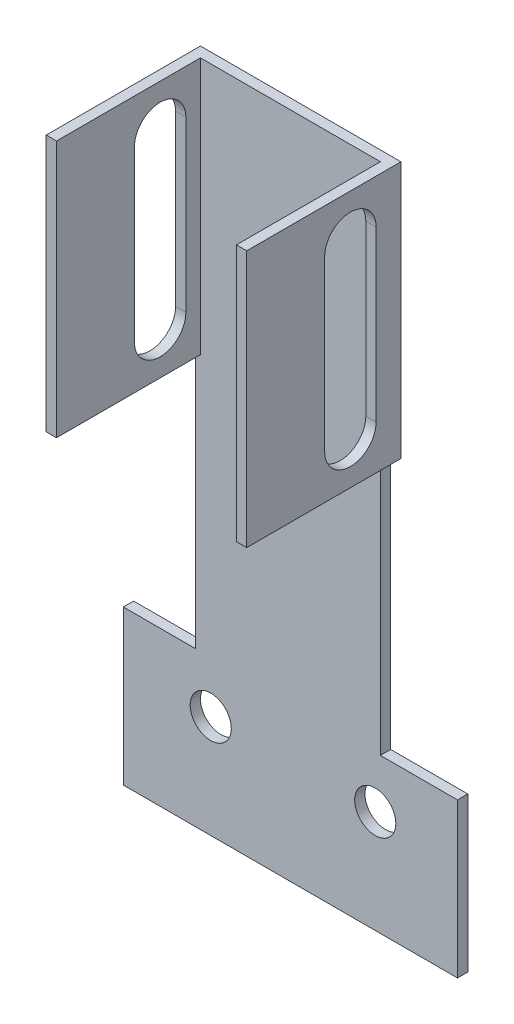
ISO-10303-21;
HEADER;
FILE_DESCRIPTION(('STEP AP214'),'2;1');
FILE_NAME('part.step','',(''),(''),'','','');
FILE_SCHEMA(('AUTOMOTIVE_DESIGN { 1 0 10303 214 1 1 1 1 }'));
ENDSEC;
DATA;
#1=APPLICATION_CONTEXT('core data for automotive mechanical design processes');
#2=APPLICATION_PROTOCOL_DEFINITION('international standard','automotive_design',2000,#1);
#3=PRODUCT_CONTEXT('',#1,'mechanical');
#4=PRODUCT('Part','Part','',(#3));
#5=PRODUCT_RELATED_PRODUCT_CATEGORY('part','',(#4));
#6=PRODUCT_DEFINITION_FORMATION('','',#4);
#7=PRODUCT_DEFINITION_CONTEXT('part definition',#1,'design');
#8=PRODUCT_DEFINITION('design','',#6,#7);
#9=PRODUCT_DEFINITION_SHAPE('','',#8);
#10=(LENGTH_UNIT() NAMED_UNIT(*) SI_UNIT(.MILLI.,.METRE.));
#11=(NAMED_UNIT(*) PLANE_ANGLE_UNIT() SI_UNIT($,.RADIAN.));
#12=(NAMED_UNIT(*) SI_UNIT($,.STERADIAN.) SOLID_ANGLE_UNIT());
#13=UNCERTAINTY_MEASURE_WITH_UNIT(LENGTH_MEASURE(1.E-05),#10,'distance_accuracy_value','');
#14=(GEOMETRIC_REPRESENTATION_CONTEXT(3) GLOBAL_UNCERTAINTY_ASSIGNED_CONTEXT((#13)) GLOBAL_UNIT_ASSIGNED_CONTEXT((#10,
#11,#12)) REPRESENTATION_CONTEXT('',''));
#15=CARTESIAN_POINT('',(0.,0.,0.));
#16=DIRECTION('',(0.,0.,1.));
#17=DIRECTION('',(1.,0.,0.));
#18=AXIS2_PLACEMENT_3D('',#15,#16,#17);
#19=CARTESIAN_POINT('',(22.4691789051287,13.9299732070661,2.));
#20=DIRECTION('',(-1.,0.,0.));
#21=DIRECTION('',(0.,0.,1.));
#22=AXIS2_PLACEMENT_3D('',#19,#20,#21);
#23=PLANE('',#22);
#24=DIRECTION('',(0.,0.,-1.));
#25=VECTOR('',#24,1.);
#26=CARTESIAN_POINT('',(22.4691789051287,63.9299732070661,0.));
#27=LINE('',#26,#25);
#28=CARTESIAN_POINT('',(22.4691789051287,63.9299732070661,2.));
#29=VERTEX_POINT('',#28);
#30=CARTESIAN_POINT('',(22.4691789051287,63.9299732070661,0.));
#31=VERTEX_POINT('',#30);
#32=EDGE_CURVE('E290',#29,#31,#27,.T.);
#33=ORIENTED_EDGE('',*,*,#32,.F.);
#34=DIRECTION('',(0.,1.,0.));
#35=VECTOR('',#34,1.);
#36=CARTESIAN_POINT('',(22.4691789051287,13.9299732070661,2.));
#37=LINE('',#36,#35);
#38=CARTESIAN_POINT('',(22.4691789051287,13.9299732070661,2.));
#39=VERTEX_POINT('',#38);
#40=EDGE_CURVE('E327',#39,#29,#37,.T.);
#41=ORIENTED_EDGE('',*,*,#40,.F.);
#42=DIRECTION('',(0.,0.,-1.));
#43=VECTOR('',#42,1.);
#44=CARTESIAN_POINT('',(22.4691789051287,13.9299732070661,2.));
#45=LINE('',#44,#43);
#46=CARTESIAN_POINT('',(22.4691789051287,13.9299732070661,0.));
#47=VERTEX_POINT('',#46);
#48=EDGE_CURVE('E359',#39,#47,#45,.T.);
#49=ORIENTED_EDGE('',*,*,#48,.T.);
#50=DIRECTION('',(0.,1.,0.));
#51=VECTOR('',#50,1.);
#52=CARTESIAN_POINT('',(22.4691789051287,13.9299732070661,0.));
#53=LINE('',#52,#51);
#54=EDGE_CURVE('E346',#47,#31,#53,.T.);
#55=ORIENTED_EDGE('',*,*,#54,.T.);
#56=EDGE_LOOP('',(#33,#41,#49,#55));
#57=FACE_BOUND('',#56,.T.);
#58=ADVANCED_FACE('F35',(#57),#23,.F.);
#59=CARTESIAN_POINT('',(0.,0.,2.));
#60=DIRECTION('',(0.,0.,-1.));
#61=DIRECTION('',(-1.,0.,0.));
#62=AXIS2_PLACEMENT_3D('',#59,#60,#61);
#63=PLANE('',#62);
#64=DIRECTION('',(0.,-1.,0.));
#65=VECTOR('',#64,1.);
#66=CARTESIAN_POINT('',(-12.5308210948713,0.,2.));
#67=LINE('',#66,#65);
#68=CARTESIAN_POINT('',(-12.5308210948713,113.929973207066,2.));
#69=VERTEX_POINT('',#68);
#70=CARTESIAN_POINT('',(-12.5308210948713,63.9299732070661,2.));
#71=VERTEX_POINT('',#70);
#72=EDGE_CURVE('E271',#69,#71,#67,.T.);
#73=ORIENTED_EDGE('',*,*,#72,.T.);
#74=DIRECTION('',(-1.,0.,0.));
#75=VECTOR('',#74,1.);
#76=CARTESIAN_POINT('',(0.,63.9299732070661,2.));
#77=LINE('',#76,#75);
#78=CARTESIAN_POINT('',(-13.5308210948713,63.9299732070661,2.));
#79=VERTEX_POINT('',#78);
#80=EDGE_CURVE('E268',#71,#79,#77,.T.);
#81=ORIENTED_EDGE('',*,*,#80,.T.);
#82=DIRECTION('',(0.,-1.,0.));
#83=VECTOR('',#82,1.);
#84=CARTESIAN_POINT('',(-13.5308210948713,13.9299732070661,2.));
#85=LINE('',#84,#83);
#86=CARTESIAN_POINT('',(-13.5308210948713,13.9299732070661,2.));
#87=VERTEX_POINT('',#86);
#88=EDGE_CURVE('E333',#79,#87,#85,.T.);
#89=ORIENTED_EDGE('',*,*,#88,.T.);
#90=DIRECTION('',(-1.,0.,0.));
#91=VECTOR('',#90,1.);
#92=CARTESIAN_POINT('',(-27.5308210948713,13.9299732070661,2.));
#93=LINE('',#92,#91);
#94=CARTESIAN_POINT('',(-27.5308210948713,13.9299732070661,2.));
#95=VERTEX_POINT('',#94);
#96=EDGE_CURVE('E335',#87,#95,#93,.T.);
#97=ORIENTED_EDGE('',*,*,#96,.T.);
#98=DIRECTION('',(0.,-1.,0.));
#99=VECTOR('',#98,1.);
#100=CARTESIAN_POINT('',(-27.5308210948713,-16.0700267929339,2.));
#101=LINE('',#100,#99);
#102=CARTESIAN_POINT('',(-27.5308210948713,-16.0700267929339,2.));
#103=VERTEX_POINT('',#102);
#104=EDGE_CURVE('E317',#95,#103,#101,.T.);
#105=ORIENTED_EDGE('',*,*,#104,.T.);
#106=DIRECTION('',(1.,0.,0.));
#107=VECTOR('',#106,1.);
#108=CARTESIAN_POINT('',(-27.5308210948713,-16.0700267929339,2.));
#109=LINE('',#108,#107);
#110=CARTESIAN_POINT('',(37.4691789051287,-16.0700267929339,2.));
#111=VERTEX_POINT('',#110);
#112=EDGE_CURVE('E320',#103,#111,#109,.T.);
#113=ORIENTED_EDGE('',*,*,#112,.T.);
#114=DIRECTION('',(0.,1.,0.));
#115=VECTOR('',#114,1.);
#116=CARTESIAN_POINT('',(37.4691789051287,-16.0700267929339,2.));
#117=LINE('',#116,#115);
#118=CARTESIAN_POINT('',(37.4691789051287,13.9299732070661,2.));
#119=VERTEX_POINT('',#118);
#120=EDGE_CURVE('E323',#111,#119,#117,.T.);
#121=ORIENTED_EDGE('',*,*,#120,.T.);
#122=DIRECTION('',(-1.,0.,0.));
#123=VECTOR('',#122,1.);
#124=CARTESIAN_POINT('',(37.4691789051287,13.9299732070661,2.));
#125=LINE('',#124,#123);
#126=EDGE_CURVE('E325',#119,#39,#125,.T.);
#127=ORIENTED_EDGE('',*,*,#126,.T.);
#128=ORIENTED_EDGE('',*,*,#40,.T.);
#129=DIRECTION('',(0.,1.,0.));
#130=VECTOR('',#129,1.);
#131=CARTESIAN_POINT('',(22.4691789051287,0.,2.));
#132=LINE('',#131,#130);
#133=CARTESIAN_POINT('',(22.4691789051287,113.929973207066,2.));
#134=VERTEX_POINT('',#133);
#135=EDGE_CURVE('E301',#29,#134,#132,.T.);
#136=ORIENTED_EDGE('',*,*,#135,.T.);
#137=DIRECTION('',(-1.,0.,0.));
#138=VECTOR('',#137,1.);
#139=CARTESIAN_POINT('',(-13.5308210948713,113.929973207066,2.));
#140=LINE('',#139,#138);
#141=EDGE_CURVE('E330',#134,#69,#140,.T.);
#142=ORIENTED_EDGE('',*,*,#141,.T.);
#143=EDGE_LOOP('',(#73,#81,#89,#97,#105,#113,#121,#127,#128,#136,#142));
#144=FACE_BOUND('',#143,.T.);
#145=CARTESIAN_POINT('',(21.4691789051287,3.92997320706607,2.));
#146=DIRECTION('',(0.,0.,1.));
#147=DIRECTION('',(1.,0.,0.));
#148=AXIS2_PLACEMENT_3D('',#145,#146,#147);
#149=CIRCLE('',#148,4.);
#150=CARTESIAN_POINT('',(25.4691789051287,3.92997320706607,2.));
#151=VERTEX_POINT('',#150);
#152=EDGE_CURVE('E311',#151,#151,#149,.T.);
#153=ORIENTED_EDGE('',*,*,#152,.F.);
#154=EDGE_LOOP('',(#153));
#155=FACE_BOUND('',#154,.T.);
#156=CARTESIAN_POINT('',(-10.5308210948713,3.92997320706607,2.));
#157=DIRECTION('',(0.,0.,1.));
#158=DIRECTION('',(1.,0.,0.));
#159=AXIS2_PLACEMENT_3D('',#156,#157,#158);
#160=CIRCLE('',#159,4.);
#161=CARTESIAN_POINT('',(-6.53082109487132,3.92997320706607,2.));
#162=VERTEX_POINT('',#161);
#163=EDGE_CURVE('E305',#162,#162,#160,.T.);
#164=ORIENTED_EDGE('',*,*,#163,.F.);
#165=EDGE_LOOP('',(#164));
#166=FACE_BOUND('',#165,.T.);
#167=ADVANCED_FACE('F417',(#144,#155,#166),#63,.F.);
#168=CARTESIAN_POINT('',(0.,0.,0.));
#169=DIRECTION('',(0.,0.,-1.));
#170=DIRECTION('',(-1.,0.,0.));
#171=AXIS2_PLACEMENT_3D('',#168,#169,#170);
#172=PLANE('',#171);
#173=DIRECTION('',(0.,-1.,0.));
#174=VECTOR('',#173,1.);
#175=CARTESIAN_POINT('',(-13.5308210948713,13.9299732070661,0.));
#176=LINE('',#175,#174);
#177=CARTESIAN_POINT('',(-13.5308210948713,63.9299732070661,0.));
#178=VERTEX_POINT('',#177);
#179=CARTESIAN_POINT('',(-13.5308210948713,13.9299732070661,0.));
#180=VERTEX_POINT('',#179);
#181=EDGE_CURVE('E351',#178,#180,#176,.T.);
#182=ORIENTED_EDGE('',*,*,#181,.F.);
#183=DIRECTION('',(1.,0.,0.));
#184=VECTOR('',#183,1.);
#185=CARTESIAN_POINT('',(-14.5308210948713,63.9299732070661,0.));
#186=LINE('',#185,#184);
#187=CARTESIAN_POINT('',(-14.5308210948713,63.9299732070661,0.));
#188=VERTEX_POINT('',#187);
#189=EDGE_CURVE('E266',#188,#178,#186,.T.);
#190=ORIENTED_EDGE('',*,*,#189,.F.);
#191=DIRECTION('',(0.,1.,0.));
#192=VECTOR('',#191,1.);
#193=CARTESIAN_POINT('',(-14.5308210948713,113.929973207066,0.));
#194=LINE('',#193,#192);
#195=CARTESIAN_POINT('',(-14.5308210948713,113.929973207066,0.));
#196=VERTEX_POINT('',#195);
#197=EDGE_CURVE('E245',#188,#196,#194,.T.);
#198=ORIENTED_EDGE('',*,*,#197,.T.);
#199=DIRECTION('',(-1.,0.,0.));
#200=VECTOR('',#199,1.);
#201=CARTESIAN_POINT('',(-13.5308210948713,113.929973207066,0.));
#202=LINE('',#201,#200);
#203=CARTESIAN_POINT('',(24.4691789051287,113.929973207066,0.));
#204=VERTEX_POINT('',#203);
#205=EDGE_CURVE('E349',#204,#196,#202,.T.);
#206=ORIENTED_EDGE('',*,*,#205,.F.);
#207=DIRECTION('',(0.,1.,0.));
#208=VECTOR('',#207,1.);
#209=CARTESIAN_POINT('',(24.4691789051287,113.929973207066,0.));
#210=LINE('',#209,#208);
#211=CARTESIAN_POINT('',(24.4691789051287,63.9299732070661,0.));
#212=VERTEX_POINT('',#211);
#213=EDGE_CURVE('E283',#212,#204,#210,.T.);
#214=ORIENTED_EDGE('',*,*,#213,.F.);
#215=DIRECTION('',(-1.,0.,0.));
#216=VECTOR('',#215,1.);
#217=CARTESIAN_POINT('',(24.4691789051287,63.9299732070661,0.));
#218=LINE('',#217,#216);
#219=EDGE_CURVE('E286',#212,#31,#218,.T.);
#220=ORIENTED_EDGE('',*,*,#219,.T.);
#221=ORIENTED_EDGE('',*,*,#54,.F.);
#222=DIRECTION('',(-1.,0.,0.));
#223=VECTOR('',#222,1.);
#224=CARTESIAN_POINT('',(37.4691789051287,13.9299732070661,0.));
#225=LINE('',#224,#223);
#226=CARTESIAN_POINT('',(37.4691789051287,13.9299732070661,0.));
#227=VERTEX_POINT('',#226);
#228=EDGE_CURVE('E344',#227,#47,#225,.T.);
#229=ORIENTED_EDGE('',*,*,#228,.F.);
#230=DIRECTION('',(0.,1.,0.));
#231=VECTOR('',#230,1.);
#232=CARTESIAN_POINT('',(37.4691789051287,-16.0700267929339,0.));
#233=LINE('',#232,#231);
#234=CARTESIAN_POINT('',(37.4691789051287,-16.0700267929339,0.));
#235=VERTEX_POINT('',#234);
#236=EDGE_CURVE('E342',#235,#227,#233,.T.);
#237=ORIENTED_EDGE('',*,*,#236,.F.);
#238=DIRECTION('',(1.,0.,0.));
#239=VECTOR('',#238,1.);
#240=CARTESIAN_POINT('',(-27.5308210948713,-16.0700267929339,0.));
#241=LINE('',#240,#239);
#242=CARTESIAN_POINT('',(-27.5308210948713,-16.0700267929339,0.));
#243=VERTEX_POINT('',#242);
#244=EDGE_CURVE('E340',#243,#235,#241,.T.);
#245=ORIENTED_EDGE('',*,*,#244,.F.);
#246=DIRECTION('',(0.,-1.,0.));
#247=VECTOR('',#246,1.);
#248=CARTESIAN_POINT('',(-27.5308210948713,-16.0700267929339,0.));
#249=LINE('',#248,#247);
#250=CARTESIAN_POINT('',(-27.5308210948713,13.9299732070661,0.));
#251=VERTEX_POINT('',#250);
#252=EDGE_CURVE('E314',#251,#243,#249,.T.);
#253=ORIENTED_EDGE('',*,*,#252,.F.);
#254=DIRECTION('',(-1.,0.,0.));
#255=VECTOR('',#254,1.);
#256=CARTESIAN_POINT('',(-27.5308210948713,13.9299732070661,0.));
#257=LINE('',#256,#255);
#258=EDGE_CURVE('E321',#180,#251,#257,.T.);
#259=ORIENTED_EDGE('',*,*,#258,.F.);
#260=EDGE_LOOP('',(#182,#190,#198,#206,#214,#220,#221,#229,#237,#245,#253,#259));
#261=FACE_BOUND('',#260,.T.);
#262=CARTESIAN_POINT('',(21.4691789051287,3.92997320706607,0.));
#263=DIRECTION('',(0.,0.,1.));
#264=DIRECTION('',(1.,0.,0.));
#265=AXIS2_PLACEMENT_3D('',#262,#263,#264);
#266=CIRCLE('',#265,4.);
#267=CARTESIAN_POINT('',(25.4691789051287,3.92997320706607,0.));
#268=VERTEX_POINT('',#267);
#269=EDGE_CURVE('E308',#268,#268,#266,.T.);
#270=ORIENTED_EDGE('',*,*,#269,.T.);
#271=EDGE_LOOP('',(#270));
#272=FACE_BOUND('',#271,.T.);
#273=CARTESIAN_POINT('',(-10.5308210948713,3.92997320706607,0.));
#274=DIRECTION('',(0.,0.,1.));
#275=DIRECTION('',(1.,0.,0.));
#276=AXIS2_PLACEMENT_3D('',#273,#274,#275);
#277=CIRCLE('',#276,4.);
#278=CARTESIAN_POINT('',(-6.53082109487132,3.92997320706607,0.));
#279=VERTEX_POINT('',#278);
#280=EDGE_CURVE('E304',#279,#279,#277,.T.);
#281=ORIENTED_EDGE('',*,*,#280,.T.);
#282=EDGE_LOOP('',(#281));
#283=FACE_BOUND('',#282,.T.);
#284=ADVANCED_FACE('F423',(#261,#272,#283),#172,.T.);
#285=CARTESIAN_POINT('',(-27.5308210948713,-16.0700267929339,2.));
#286=DIRECTION('',(1.,0.,0.));
#287=DIRECTION('',(0.,0.,-1.));
#288=AXIS2_PLACEMENT_3D('',#285,#286,#287);
#289=PLANE('',#288);
#290=ORIENTED_EDGE('',*,*,#252,.T.);
#291=DIRECTION('',(0.,0.,-1.));
#292=VECTOR('',#291,1.);
#293=CARTESIAN_POINT('',(-27.5308210948713,-16.0700267929339,2.));
#294=LINE('',#293,#292);
#295=EDGE_CURVE('E368',#103,#243,#294,.T.);
#296=ORIENTED_EDGE('',*,*,#295,.F.);
#297=ORIENTED_EDGE('',*,*,#104,.F.);
#298=DIRECTION('',(0.,0.,-1.));
#299=VECTOR('',#298,1.);
#300=CARTESIAN_POINT('',(-27.5308210948713,13.9299732070661,2.));
#301=LINE('',#300,#299);
#302=EDGE_CURVE('E337',#95,#251,#301,.T.);
#303=ORIENTED_EDGE('',*,*,#302,.T.);
#304=EDGE_LOOP('',(#290,#296,#297,#303));
#305=FACE_BOUND('',#304,.T.);
#306=ADVANCED_FACE('F37',(#305),#289,.F.);
#307=CARTESIAN_POINT('',(-27.5308210948713,-16.0700267929339,2.));
#308=DIRECTION('',(0.,1.,0.));
#309=DIRECTION('',(0.,0.,1.));
#310=AXIS2_PLACEMENT_3D('',#307,#308,#309);
#311=PLANE('',#310);
#312=ORIENTED_EDGE('',*,*,#244,.T.);
#313=DIRECTION('',(0.,0.,-1.));
#314=VECTOR('',#313,1.);
#315=CARTESIAN_POINT('',(37.4691789051287,-16.0700267929339,2.));
#316=LINE('',#315,#314);
#317=EDGE_CURVE('E365',#111,#235,#316,.T.);
#318=ORIENTED_EDGE('',*,*,#317,.F.);
#319=ORIENTED_EDGE('',*,*,#112,.F.);
#320=ORIENTED_EDGE('',*,*,#295,.T.);
#321=EDGE_LOOP('',(#312,#318,#319,#320));
#322=FACE_BOUND('',#321,.T.);
#323=ADVANCED_FACE('F437',(#322),#311,.F.);
#324=CARTESIAN_POINT('',(37.4691789051287,-16.0700267929339,2.));
#325=DIRECTION('',(-1.,0.,0.));
#326=DIRECTION('',(0.,0.,1.));
#327=AXIS2_PLACEMENT_3D('',#324,#325,#326);
#328=PLANE('',#327);
#329=ORIENTED_EDGE('',*,*,#236,.T.);
#330=DIRECTION('',(0.,0.,-1.));
#331=VECTOR('',#330,1.);
#332=CARTESIAN_POINT('',(37.4691789051287,13.9299732070661,2.));
#333=LINE('',#332,#331);
#334=EDGE_CURVE('E362',#119,#227,#333,.T.);
#335=ORIENTED_EDGE('',*,*,#334,.F.);
#336=ORIENTED_EDGE('',*,*,#120,.F.);
#337=ORIENTED_EDGE('',*,*,#317,.T.);
#338=EDGE_LOOP('',(#329,#335,#336,#337));
#339=FACE_BOUND('',#338,.T.);
#340=ADVANCED_FACE('F434',(#339),#328,.F.);
#341=CARTESIAN_POINT('',(37.4691789051287,13.9299732070661,2.));
#342=DIRECTION('',(0.,-1.,0.));
#343=DIRECTION('',(1.,0.,0.));
#344=AXIS2_PLACEMENT_3D('',#341,#342,#343);
#345=PLANE('',#344);
#346=ORIENTED_EDGE('',*,*,#228,.T.);
#347=ORIENTED_EDGE('',*,*,#48,.F.);
#348=ORIENTED_EDGE('',*,*,#126,.F.);
#349=ORIENTED_EDGE('',*,*,#334,.T.);
#350=EDGE_LOOP('',(#346,#347,#348,#349));
#351=FACE_BOUND('',#350,.T.);
#352=ADVANCED_FACE('F431',(#351),#345,.F.);
#353=CARTESIAN_POINT('',(-13.5308210948713,113.929973207066,2.));
#354=DIRECTION('',(0.,-1.,0.));
#355=DIRECTION('',(0.,0.,-1.));
#356=AXIS2_PLACEMENT_3D('',#353,#354,#355);
#357=PLANE('',#356);
#358=DIRECTION('',(0.,0.,1.));
#359=VECTOR('',#358,1.);
#360=CARTESIAN_POINT('',(-12.5308210948713,113.929973207066,30.));
#361=LINE('',#360,#359);
#362=CARTESIAN_POINT('',(-12.5308210948713,113.929973207066,30.));
#363=VERTEX_POINT('',#362);
#364=EDGE_CURVE('E241',#69,#363,#361,.T.);
#365=ORIENTED_EDGE('',*,*,#364,.F.);
#366=ORIENTED_EDGE('',*,*,#141,.F.);
#367=DIRECTION('',(0.,0.,1.));
#368=VECTOR('',#367,1.);
#369=CARTESIAN_POINT('',(22.4691789051287,113.929973207066,30.));
#370=LINE('',#369,#368);
#371=CARTESIAN_POINT('',(22.4691789051287,113.929973207066,30.));
#372=VERTEX_POINT('',#371);
#373=EDGE_CURVE('E274',#134,#372,#370,.T.);
#374=ORIENTED_EDGE('',*,*,#373,.T.);
#375=DIRECTION('',(-1.,0.,0.));
#376=VECTOR('',#375,1.);
#377=CARTESIAN_POINT('',(24.4691789051287,113.929973207066,30.));
#378=LINE('',#377,#376);
#379=CARTESIAN_POINT('',(24.4691789051287,113.929973207066,30.));
#380=VERTEX_POINT('',#379);
#381=EDGE_CURVE('E298',#380,#372,#378,.T.);
#382=ORIENTED_EDGE('',*,*,#381,.F.);
#383=DIRECTION('',(0.,0.,1.));
#384=VECTOR('',#383,1.);
#385=CARTESIAN_POINT('',(24.4691789051287,113.929973207066,30.));
#386=LINE('',#385,#384);
#387=EDGE_CURVE('E275',#204,#380,#386,.T.);
#388=ORIENTED_EDGE('',*,*,#387,.F.);
#389=ORIENTED_EDGE('',*,*,#205,.T.);
#390=DIRECTION('',(0.,0.,1.));
#391=VECTOR('',#390,1.);
#392=CARTESIAN_POINT('',(-14.5308210948713,113.929973207066,30.));
#393=LINE('',#392,#391);
#394=CARTESIAN_POINT('',(-14.5308210948713,113.929973207066,30.));
#395=VERTEX_POINT('',#394);
#396=EDGE_CURVE('E242',#196,#395,#393,.T.);
#397=ORIENTED_EDGE('',*,*,#396,.T.);
#398=DIRECTION('',(1.,0.,0.));
#399=VECTOR('',#398,1.);
#400=CARTESIAN_POINT('',(-14.5308210948713,113.929973207066,30.));
#401=LINE('',#400,#399);
#402=EDGE_CURVE('E255',#395,#363,#401,.T.);
#403=ORIENTED_EDGE('',*,*,#402,.T.);
#404=EDGE_LOOP('',(#365,#366,#374,#382,#388,#389,#397,#403));
#405=FACE_BOUND('',#404,.T.);
#406=ADVANCED_FACE('F429',(#405),#357,.F.);
#407=CARTESIAN_POINT('',(-13.5308210948713,13.9299732070661,2.));
#408=DIRECTION('',(1.,0.,0.));
#409=DIRECTION('',(0.,0.,-1.));
#410=AXIS2_PLACEMENT_3D('',#407,#408,#409);
#411=PLANE('',#410);
#412=ORIENTED_EDGE('',*,*,#88,.F.);
#413=DIRECTION('',(0.,0.,-1.));
#414=VECTOR('',#413,1.);
#415=CARTESIAN_POINT('',(-13.5308210948713,63.9299732070661,2.));
#416=LINE('',#415,#414);
#417=EDGE_CURVE('E371',#79,#178,#416,.T.);
#418=ORIENTED_EDGE('',*,*,#417,.T.);
#419=ORIENTED_EDGE('',*,*,#181,.T.);
#420=DIRECTION('',(0.,0.,-1.));
#421=VECTOR('',#420,1.);
#422=CARTESIAN_POINT('',(-13.5308210948713,13.9299732070661,2.));
#423=LINE('',#422,#421);
#424=EDGE_CURVE('E356',#87,#180,#423,.T.);
#425=ORIENTED_EDGE('',*,*,#424,.F.);
#426=EDGE_LOOP('',(#412,#418,#419,#425));
#427=FACE_BOUND('',#426,.T.);
#428=ADVANCED_FACE('F470',(#427),#411,.F.);
#429=CARTESIAN_POINT('',(-27.5308210948713,13.9299732070661,2.));
#430=DIRECTION('',(0.,-1.,0.));
#431=DIRECTION('',(0.,0.,-1.));
#432=AXIS2_PLACEMENT_3D('',#429,#430,#431);
#433=PLANE('',#432);
#434=ORIENTED_EDGE('',*,*,#258,.T.);
#435=ORIENTED_EDGE('',*,*,#302,.F.);
#436=ORIENTED_EDGE('',*,*,#96,.F.);
#437=ORIENTED_EDGE('',*,*,#424,.T.);
#438=EDGE_LOOP('',(#434,#435,#436,#437));
#439=FACE_BOUND('',#438,.T.);
#440=ADVANCED_FACE('F466',(#439),#433,.F.);
#441=CARTESIAN_POINT('',(21.4691789051287,3.92997320706607,2.));
#442=DIRECTION('',(0.,0.,-1.));
#443=DIRECTION('',(-1.,0.,0.));
#444=AXIS2_PLACEMENT_3D('',#441,#442,#443);
#445=CYLINDRICAL_SURFACE('',#444,4.);
#446=ORIENTED_EDGE('',*,*,#152,.T.);
#447=EDGE_LOOP('',(#446));
#448=FACE_BOUND('',#447,.T.);
#449=ORIENTED_EDGE('',*,*,#269,.F.);
#450=EDGE_LOOP('',(#449));
#451=FACE_BOUND('',#450,.T.);
#452=ADVANCED_FACE('F505',(#448,#451),#445,.F.);
#453=CARTESIAN_POINT('',(-10.5308210948713,3.92997320706607,2.));
#454=DIRECTION('',(0.,0.,-1.));
#455=DIRECTION('',(-1.,0.,0.));
#456=AXIS2_PLACEMENT_3D('',#453,#454,#455);
#457=CYLINDRICAL_SURFACE('',#456,4.);
#458=ORIENTED_EDGE('',*,*,#163,.T.);
#459=EDGE_LOOP('',(#458));
#460=FACE_BOUND('',#459,.T.);
#461=ORIENTED_EDGE('',*,*,#280,.F.);
#462=EDGE_LOOP('',(#461));
#463=FACE_BOUND('',#462,.T.);
#464=ADVANCED_FACE('F497',(#460,#463),#457,.F.);
#465=CARTESIAN_POINT('',(22.4691789051287,0.,0.));
#466=DIRECTION('',(-1.,0.,0.));
#467=DIRECTION('',(0.,0.,1.));
#468=AXIS2_PLACEMENT_3D('',#465,#466,#467);
#469=PLANE('',#468);
#470=CARTESIAN_POINT('',(22.4691789051287,105.365677930493,9.83736051852604));
#471=DIRECTION('',(-1.,0.,0.));
#472=DIRECTION('',(0.,0.,1.));
#473=AXIS2_PLACEMENT_3D('',#470,#471,#472);
#474=CIRCLE('',#473,5.);
#475=CARTESIAN_POINT('',(22.4691789051287,105.365677930493,14.837360518526));
#476=VERTEX_POINT('',#475);
#477=CARTESIAN_POINT('',(22.4691789051287,105.365677930493,4.83736051852604));
#478=VERTEX_POINT('',#477);
#479=EDGE_CURVE('E239',#476,#478,#474,.T.);
#480=ORIENTED_EDGE('',*,*,#479,.F.);
#481=DIRECTION('',(0.,1.,0.));
#482=VECTOR('',#481,1.);
#483=CARTESIAN_POINT('',(22.4691789051287,0.,14.837360518526));
#484=LINE('',#483,#482);
#485=CARTESIAN_POINT('',(22.4691789051287,72.4942684836388,14.837360518526));
#486=VERTEX_POINT('',#485);
#487=EDGE_CURVE('E227',#486,#476,#484,.T.);
#488=ORIENTED_EDGE('',*,*,#487,.F.);
#489=CARTESIAN_POINT('',(22.4691789051287,72.4942684836388,9.83736051852605));
#490=DIRECTION('',(-1.,0.,0.));
#491=DIRECTION('',(0.,0.,1.));
#492=AXIS2_PLACEMENT_3D('',#489,#490,#491);
#493=CIRCLE('',#492,5.);
#494=CARTESIAN_POINT('',(22.4691789051287,72.4942684836388,4.83736051852605));
#495=VERTEX_POINT('',#494);
#496=EDGE_CURVE('E199',#495,#486,#493,.T.);
#497=ORIENTED_EDGE('',*,*,#496,.F.);
#498=DIRECTION('',(0.,-1.,0.));
#499=VECTOR('',#498,1.);
#500=CARTESIAN_POINT('',(22.4691789051287,0.,4.83736051852604));
#501=LINE('',#500,#499);
#502=EDGE_CURVE('E234',#478,#495,#501,.T.);
#503=ORIENTED_EDGE('',*,*,#502,.F.);
#504=EDGE_LOOP('',(#480,#488,#497,#503));
#505=FACE_BOUND('',#504,.T.);
#506=ORIENTED_EDGE('',*,*,#135,.F.);
#507=CARTESIAN_POINT('',(22.4691789051287,63.9299732070661,30.));
#508=VERTEX_POINT('',#507);
#509=EDGE_CURVE('E279',#508,#29,#27,.T.);
#510=ORIENTED_EDGE('',*,*,#509,.F.);
#511=DIRECTION('',(0.,-1.,0.));
#512=VECTOR('',#511,1.);
#513=CARTESIAN_POINT('',(22.4691789051287,63.9299732070661,30.));
#514=LINE('',#513,#512);
#515=EDGE_CURVE('E288',#372,#508,#514,.T.);
#516=ORIENTED_EDGE('',*,*,#515,.F.);
#517=ORIENTED_EDGE('',*,*,#373,.F.);
#518=EDGE_LOOP('',(#506,#510,#516,#517));
#519=FACE_BOUND('',#518,.T.);
#520=ADVANCED_FACE('F495',(#505,#519),#469,.T.);
#521=CARTESIAN_POINT('',(24.4691789051287,63.9299732070661,30.));
#522=DIRECTION('',(0.,0.,-1.));
#523=DIRECTION('',(-1.,0.,0.));
#524=AXIS2_PLACEMENT_3D('',#521,#522,#523);
#525=PLANE('',#524);
#526=ORIENTED_EDGE('',*,*,#515,.T.);
#527=DIRECTION('',(-1.,0.,0.));
#528=VECTOR('',#527,1.);
#529=CARTESIAN_POINT('',(24.4691789051287,63.9299732070661,30.));
#530=LINE('',#529,#528);
#531=CARTESIAN_POINT('',(24.4691789051287,63.9299732070661,30.));
#532=VERTEX_POINT('',#531);
#533=EDGE_CURVE('E295',#532,#508,#530,.T.);
#534=ORIENTED_EDGE('',*,*,#533,.F.);
#535=DIRECTION('',(0.,-1.,0.));
#536=VECTOR('',#535,1.);
#537=CARTESIAN_POINT('',(24.4691789051287,63.9299732070661,30.));
#538=LINE('',#537,#536);
#539=EDGE_CURVE('E278',#380,#532,#538,.T.);
#540=ORIENTED_EDGE('',*,*,#539,.F.);
#541=ORIENTED_EDGE('',*,*,#381,.T.);
#542=EDGE_LOOP('',(#526,#534,#540,#541));
#543=FACE_BOUND('',#542,.T.);
#544=ADVANCED_FACE('F489',(#543),#525,.F.);
#545=CARTESIAN_POINT('',(24.4691789051287,63.9299732070661,0.));
#546=DIRECTION('',(0.,1.,0.));
#547=DIRECTION('',(0.,0.,1.));
#548=AXIS2_PLACEMENT_3D('',#545,#546,#547);
#549=PLANE('',#548);
#550=ORIENTED_EDGE('',*,*,#509,.T.);
#551=ORIENTED_EDGE('',*,*,#32,.T.);
#552=ORIENTED_EDGE('',*,*,#219,.F.);
#553=DIRECTION('',(0.,0.,-1.));
#554=VECTOR('',#553,1.);
#555=CARTESIAN_POINT('',(24.4691789051287,63.9299732070661,0.));
#556=LINE('',#555,#554);
#557=EDGE_CURVE('E281',#532,#212,#556,.T.);
#558=ORIENTED_EDGE('',*,*,#557,.F.);
#559=ORIENTED_EDGE('',*,*,#533,.T.);
#560=EDGE_LOOP('',(#550,#551,#552,#558,#559));
#561=FACE_BOUND('',#560,.T.);
#562=ADVANCED_FACE('F493',(#561),#549,.F.);
#563=CARTESIAN_POINT('',(24.4691789051287,0.,0.));
#564=DIRECTION('',(-1.,0.,0.));
#565=DIRECTION('',(0.,0.,1.));
#566=AXIS2_PLACEMENT_3D('',#563,#564,#565);
#567=PLANE('',#566);
#568=DIRECTION('',(0.,-1.,0.));
#569=VECTOR('',#568,1.);
#570=CARTESIAN_POINT('',(24.4691789051287,105.365677930493,14.837360518526));
#571=LINE('',#570,#569);
#572=CARTESIAN_POINT('',(24.4691789051287,105.365677930493,14.837360518526));
#573=VERTEX_POINT('',#572);
#574=CARTESIAN_POINT('',(24.4691789051287,72.4942684836388,14.837360518526));
#575=VERTEX_POINT('',#574);
#576=EDGE_CURVE('E205',#573,#575,#571,.T.);
#577=ORIENTED_EDGE('',*,*,#576,.F.);
#578=CARTESIAN_POINT('',(24.4691789051287,105.365677930493,9.83736051852604));
#579=DIRECTION('',(1.,0.,0.));
#580=DIRECTION('',(0.,0.,-1.));
#581=AXIS2_PLACEMENT_3D('',#578,#579,#580);
#582=CIRCLE('',#581,5.);
#583=CARTESIAN_POINT('',(24.4691789051287,105.365677930493,4.83736051852604));
#584=VERTEX_POINT('',#583);
#585=EDGE_CURVE('E58',#584,#573,#582,.T.);
#586=ORIENTED_EDGE('',*,*,#585,.F.);
#587=DIRECTION('',(0.,1.,0.));
#588=VECTOR('',#587,1.);
#589=CARTESIAN_POINT('',(24.4691789051287,105.365677930493,4.83736051852604));
#590=LINE('',#589,#588);
#591=CARTESIAN_POINT('',(24.4691789051287,72.4942684836388,4.83736051852605));
#592=VERTEX_POINT('',#591);
#593=EDGE_CURVE('E213',#592,#584,#590,.T.);
#594=ORIENTED_EDGE('',*,*,#593,.F.);
#595=CARTESIAN_POINT('',(24.4691789051287,72.4942684836388,9.83736051852605));
#596=DIRECTION('',(1.,0.,0.));
#597=DIRECTION('',(0.,0.,-1.));
#598=AXIS2_PLACEMENT_3D('',#595,#596,#597);
#599=CIRCLE('',#598,5.);
#600=EDGE_CURVE('E196',#575,#592,#599,.T.);
#601=ORIENTED_EDGE('',*,*,#600,.F.);
#602=EDGE_LOOP('',(#577,#586,#594,#601));
#603=FACE_BOUND('',#602,.T.);
#604=ORIENTED_EDGE('',*,*,#387,.T.);
#605=ORIENTED_EDGE('',*,*,#539,.T.);
#606=ORIENTED_EDGE('',*,*,#557,.T.);
#607=ORIENTED_EDGE('',*,*,#213,.T.);
#608=EDGE_LOOP('',(#604,#605,#606,#607));
#609=FACE_BOUND('',#608,.T.);
#610=ADVANCED_FACE('F210',(#603,#609),#567,.F.);
#611=CARTESIAN_POINT('',(-12.5308210948713,0.,0.));
#612=DIRECTION('',(1.,0.,0.));
#613=DIRECTION('',(0.,0.,1.));
#614=AXIS2_PLACEMENT_3D('',#611,#612,#613);
#615=PLANE('',#614);
#616=CARTESIAN_POINT('',(-12.5308210948713,105.365677930493,9.83736051852604));
#617=DIRECTION('',(1.,0.,0.));
#618=DIRECTION('',(0.,0.,-1.));
#619=AXIS2_PLACEMENT_3D('',#616,#617,#618);
#620=CIRCLE('',#619,5.);
#621=CARTESIAN_POINT('',(-12.5308210948713,105.365677930493,4.83736051852604));
#622=VERTEX_POINT('',#621);
#623=CARTESIAN_POINT('',(-12.5308210948713,105.365677930493,14.837360518526));
#624=VERTEX_POINT('',#623);
#625=EDGE_CURVE('E236',#622,#624,#620,.T.);
#626=ORIENTED_EDGE('',*,*,#625,.F.);
#627=DIRECTION('',(0.,1.,0.));
#628=VECTOR('',#627,1.);
#629=CARTESIAN_POINT('',(-12.5308210948713,0.,4.83736051852604));
#630=LINE('',#629,#628);
#631=CARTESIAN_POINT('',(-12.5308210948713,72.4942684836388,4.83736051852605));
#632=VERTEX_POINT('',#631);
#633=EDGE_CURVE('E232',#632,#622,#630,.T.);
#634=ORIENTED_EDGE('',*,*,#633,.F.);
#635=CARTESIAN_POINT('',(-12.5308210948713,72.4942684836388,9.83736051852605));
#636=DIRECTION('',(1.,0.,0.));
#637=DIRECTION('',(0.,0.,-1.));
#638=AXIS2_PLACEMENT_3D('',#635,#636,#637);
#639=CIRCLE('',#638,5.);
#640=CARTESIAN_POINT('',(-12.5308210948713,72.4942684836388,14.837360518526));
#641=VERTEX_POINT('',#640);
#642=EDGE_CURVE('E229',#641,#632,#639,.T.);
#643=ORIENTED_EDGE('',*,*,#642,.F.);
#644=DIRECTION('',(0.,-1.,0.));
#645=VECTOR('',#644,1.);
#646=CARTESIAN_POINT('',(-12.5308210948713,0.,14.837360518526));
#647=LINE('',#646,#645);
#648=EDGE_CURVE('E225',#624,#641,#647,.T.);
#649=ORIENTED_EDGE('',*,*,#648,.F.);
#650=EDGE_LOOP('',(#626,#634,#643,#649));
#651=FACE_BOUND('',#650,.T.);
#652=ORIENTED_EDGE('',*,*,#72,.F.);
#653=ORIENTED_EDGE('',*,*,#364,.T.);
#654=DIRECTION('',(0.,-1.,0.));
#655=VECTOR('',#654,1.);
#656=CARTESIAN_POINT('',(-12.5308210948713,63.9299732070661,30.));
#657=LINE('',#656,#655);
#658=CARTESIAN_POINT('',(-12.5308210948713,63.9299732070661,30.));
#659=VERTEX_POINT('',#658);
#660=EDGE_CURVE('E246',#363,#659,#657,.T.);
#661=ORIENTED_EDGE('',*,*,#660,.T.);
#662=DIRECTION('',(0.,0.,-1.));
#663=VECTOR('',#662,1.);
#664=CARTESIAN_POINT('',(-12.5308210948713,63.9299732070661,0.));
#665=LINE('',#664,#663);
#666=EDGE_CURVE('E257',#659,#71,#665,.T.);
#667=ORIENTED_EDGE('',*,*,#666,.T.);
#668=EDGE_LOOP('',(#652,#653,#661,#667));
#669=FACE_BOUND('',#668,.T.);
#670=ADVANCED_FACE('F398',(#651,#669),#615,.T.);
#671=CARTESIAN_POINT('',(-14.5308210948713,63.9299732070661,0.));
#672=DIRECTION('',(0.,-1.,0.));
#673=DIRECTION('',(0.,0.,-1.));
#674=AXIS2_PLACEMENT_3D('',#671,#672,#673);
#675=PLANE('',#674);
#676=ORIENTED_EDGE('',*,*,#80,.F.);
#677=ORIENTED_EDGE('',*,*,#666,.F.);
#678=DIRECTION('',(1.,0.,0.));
#679=VECTOR('',#678,1.);
#680=CARTESIAN_POINT('',(-14.5308210948713,63.9299732070661,30.));
#681=LINE('',#680,#679);
#682=CARTESIAN_POINT('',(-14.5308210948713,63.9299732070661,30.));
#683=VERTEX_POINT('',#682);
#684=EDGE_CURVE('E264',#683,#659,#681,.T.);
#685=ORIENTED_EDGE('',*,*,#684,.F.);
#686=DIRECTION('',(0.,0.,-1.));
#687=VECTOR('',#686,1.);
#688=CARTESIAN_POINT('',(-14.5308210948713,63.9299732070661,0.));
#689=LINE('',#688,#687);
#690=EDGE_CURVE('E249',#683,#188,#689,.T.);
#691=ORIENTED_EDGE('',*,*,#690,.T.);
#692=ORIENTED_EDGE('',*,*,#189,.T.);
#693=ORIENTED_EDGE('',*,*,#417,.F.);
#694=EDGE_LOOP('',(#676,#677,#685,#691,#692,#693));
#695=FACE_BOUND('',#694,.T.);
#696=ADVANCED_FACE('F472',(#695),#675,.T.);
#697=CARTESIAN_POINT('',(-14.5308210948713,63.9299732070661,30.));
#698=DIRECTION('',(0.,0.,1.));
#699=DIRECTION('',(1.,0.,0.));
#700=AXIS2_PLACEMENT_3D('',#697,#698,#699);
#701=PLANE('',#700);
#702=ORIENTED_EDGE('',*,*,#660,.F.);
#703=ORIENTED_EDGE('',*,*,#402,.F.);
#704=DIRECTION('',(0.,-1.,0.));
#705=VECTOR('',#704,1.);
#706=CARTESIAN_POINT('',(-14.5308210948713,63.9299732070661,30.));
#707=LINE('',#706,#705);
#708=EDGE_CURVE('E252',#395,#683,#707,.T.);
#709=ORIENTED_EDGE('',*,*,#708,.T.);
#710=ORIENTED_EDGE('',*,*,#684,.T.);
#711=EDGE_LOOP('',(#702,#703,#709,#710));
#712=FACE_BOUND('',#711,.T.);
#713=ADVANCED_FACE('F412',(#712),#701,.T.);
#714=CARTESIAN_POINT('',(-14.5308210948713,0.,0.));
#715=DIRECTION('',(1.,0.,0.));
#716=DIRECTION('',(0.,0.,1.));
#717=AXIS2_PLACEMENT_3D('',#714,#715,#716);
#718=PLANE('',#717);
#719=DIRECTION('',(0.,1.,0.));
#720=VECTOR('',#719,1.);
#721=CARTESIAN_POINT('',(-14.5308210948713,0.,4.83736051852604));
#722=LINE('',#721,#720);
#723=CARTESIAN_POINT('',(-14.5308210948713,72.4942684836388,4.83736051852605));
#724=VERTEX_POINT('',#723);
#725=CARTESIAN_POINT('',(-14.5308210948713,105.365677930493,4.83736051852604));
#726=VERTEX_POINT('',#725);
#727=EDGE_CURVE('E43',#724,#726,#722,.T.);
#728=ORIENTED_EDGE('',*,*,#727,.T.);
#729=CARTESIAN_POINT('',(-14.5308210948713,105.365677930493,9.83736051852604));
#730=DIRECTION('',(1.,0.,0.));
#731=DIRECTION('',(0.,0.,-1.));
#732=AXIS2_PLACEMENT_3D('',#729,#730,#731);
#733=CIRCLE('',#732,5.);
#734=CARTESIAN_POINT('',(-14.5308210948713,105.365677930493,14.837360518526));
#735=VERTEX_POINT('',#734);
#736=EDGE_CURVE('E11',#726,#735,#733,.T.);
#737=ORIENTED_EDGE('',*,*,#736,.T.);
#738=DIRECTION('',(0.,-1.,0.));
#739=VECTOR('',#738,1.);
#740=CARTESIAN_POINT('',(-14.5308210948713,0.,14.837360518526));
#741=LINE('',#740,#739);
#742=CARTESIAN_POINT('',(-14.5308210948713,72.4942684836388,14.837360518526));
#743=VERTEX_POINT('',#742);
#744=EDGE_CURVE('E374',#735,#743,#741,.T.);
#745=ORIENTED_EDGE('',*,*,#744,.T.);
#746=CARTESIAN_POINT('',(-14.5308210948713,72.4942684836388,9.83736051852605));
#747=DIRECTION('',(1.,0.,0.));
#748=DIRECTION('',(0.,0.,-1.));
#749=AXIS2_PLACEMENT_3D('',#746,#747,#748);
#750=CIRCLE('',#749,5.);
#751=EDGE_CURVE('E377',#743,#724,#750,.T.);
#752=ORIENTED_EDGE('',*,*,#751,.T.);
#753=EDGE_LOOP('',(#728,#737,#745,#752));
#754=FACE_BOUND('',#753,.T.);
#755=ORIENTED_EDGE('',*,*,#396,.F.);
#756=ORIENTED_EDGE('',*,*,#197,.F.);
#757=ORIENTED_EDGE('',*,*,#690,.F.);
#758=ORIENTED_EDGE('',*,*,#708,.F.);
#759=EDGE_LOOP('',(#755,#756,#757,#758));
#760=FACE_BOUND('',#759,.T.);
#761=ADVANCED_FACE('F381',(#754,#760),#718,.F.);
#762=CARTESIAN_POINT('',(-30.5308210948713,105.365677930493,14.837360518526));
#763=DIRECTION('',(0.,0.,1.));
#764=DIRECTION('',(1.,0.,0.));
#765=AXIS2_PLACEMENT_3D('',#762,#763,#764);
#766=PLANE('',#765);
#767=ORIENTED_EDGE('',*,*,#648,.T.);
#768=DIRECTION('',(1.,0.,0.));
#769=VECTOR('',#768,1.);
#770=CARTESIAN_POINT('',(-30.5308210948713,72.4942684836388,14.837360518526));
#771=LINE('',#770,#769);
#772=EDGE_CURVE('E201',#743,#641,#771,.T.);
#773=ORIENTED_EDGE('',*,*,#772,.F.);
#774=ORIENTED_EDGE('',*,*,#744,.F.);
#775=DIRECTION('',(1.,0.,0.));
#776=VECTOR('',#775,1.);
#777=CARTESIAN_POINT('',(-30.5308210948713,105.365677930493,14.837360518526));
#778=LINE('',#777,#776);
#779=EDGE_CURVE('E202',#735,#624,#778,.T.);
#780=ORIENTED_EDGE('',*,*,#779,.T.);
#781=EDGE_LOOP('',(#767,#773,#774,#780));
#782=FACE_BOUND('',#781,.T.);
#783=ADVANCED_FACE('F404',(#782),#766,.F.);
#784=CARTESIAN_POINT('',(-30.5308210948713,72.4942684836388,9.83736051852605));
#785=DIRECTION('',(1.,0.,0.));
#786=DIRECTION('',(0.,0.,-1.));
#787=AXIS2_PLACEMENT_3D('',#784,#785,#786);
#788=CYLINDRICAL_SURFACE('',#787,5.);
#789=ORIENTED_EDGE('',*,*,#642,.T.);
#790=DIRECTION('',(1.,0.,0.));
#791=VECTOR('',#790,1.);
#792=CARTESIAN_POINT('',(-30.5308210948713,72.4942684836388,4.83736051852605));
#793=LINE('',#792,#791);
#794=EDGE_CURVE('E221',#724,#632,#793,.T.);
#795=ORIENTED_EDGE('',*,*,#794,.F.);
#796=ORIENTED_EDGE('',*,*,#751,.F.);
#797=ORIENTED_EDGE('',*,*,#772,.T.);
#798=EDGE_LOOP('',(#789,#795,#796,#797));
#799=FACE_BOUND('',#798,.T.);
#800=ADVANCED_FACE('F392',(#799),#788,.F.);
#801=CARTESIAN_POINT('',(-30.5308210948713,105.365677930493,4.83736051852604));
#802=DIRECTION('',(0.,0.,-1.));
#803=DIRECTION('',(0.,1.,0.));
#804=AXIS2_PLACEMENT_3D('',#801,#802,#803);
#805=PLANE('',#804);
#806=ORIENTED_EDGE('',*,*,#633,.T.);
#807=DIRECTION('',(1.,0.,0.));
#808=VECTOR('',#807,1.);
#809=CARTESIAN_POINT('',(-30.5308210948713,105.365677930493,4.83736051852604));
#810=LINE('',#809,#808);
#811=EDGE_CURVE('E220',#726,#622,#810,.T.);
#812=ORIENTED_EDGE('',*,*,#811,.F.);
#813=ORIENTED_EDGE('',*,*,#727,.F.);
#814=ORIENTED_EDGE('',*,*,#794,.T.);
#815=EDGE_LOOP('',(#806,#812,#813,#814));
#816=FACE_BOUND('',#815,.T.);
#817=ADVANCED_FACE('F388',(#816),#805,.F.);
#818=CARTESIAN_POINT('',(-30.5308210948713,105.365677930493,9.83736051852604));
#819=DIRECTION('',(1.,0.,0.));
#820=DIRECTION('',(0.,0.,-1.));
#821=AXIS2_PLACEMENT_3D('',#818,#819,#820);
#822=CYLINDRICAL_SURFACE('',#821,5.);
#823=ORIENTED_EDGE('',*,*,#625,.T.);
#824=ORIENTED_EDGE('',*,*,#779,.F.);
#825=ORIENTED_EDGE('',*,*,#736,.F.);
#826=ORIENTED_EDGE('',*,*,#811,.T.);
#827=EDGE_LOOP('',(#823,#824,#825,#826));
#828=FACE_BOUND('',#827,.T.);
#829=ADVANCED_FACE('F401',(#828),#822,.F.);
#830=ORIENTED_EDGE('',*,*,#479,.T.);
#831=EDGE_CURVE('E218',#478,#584,#810,.T.);
#832=ORIENTED_EDGE('',*,*,#831,.T.);
#833=ORIENTED_EDGE('',*,*,#585,.T.);
#834=EDGE_CURVE('E207',#476,#573,#778,.T.);
#835=ORIENTED_EDGE('',*,*,#834,.F.);
#836=EDGE_LOOP('',(#830,#832,#833,#835));
#837=FACE_BOUND('',#836,.T.);
#838=ADVANCED_FACE('F666',(#837),#822,.F.);
#839=ORIENTED_EDGE('',*,*,#502,.T.);
#840=EDGE_CURVE('E222',#495,#592,#793,.T.);
#841=ORIENTED_EDGE('',*,*,#840,.T.);
#842=ORIENTED_EDGE('',*,*,#593,.T.);
#843=ORIENTED_EDGE('',*,*,#831,.F.);
#844=EDGE_LOOP('',(#839,#841,#842,#843));
#845=FACE_BOUND('',#844,.T.);
#846=ADVANCED_FACE('F658',(#845),#805,.F.);
#847=ORIENTED_EDGE('',*,*,#496,.T.);
#848=EDGE_CURVE('E50',#486,#575,#771,.T.);
#849=ORIENTED_EDGE('',*,*,#848,.T.);
#850=ORIENTED_EDGE('',*,*,#600,.T.);
#851=ORIENTED_EDGE('',*,*,#840,.F.);
#852=EDGE_LOOP('',(#847,#849,#850,#851));
#853=FACE_BOUND('',#852,.T.);
#854=ADVANCED_FACE('F193',(#853),#788,.F.);
#855=ORIENTED_EDGE('',*,*,#487,.T.);
#856=ORIENTED_EDGE('',*,*,#834,.T.);
#857=ORIENTED_EDGE('',*,*,#576,.T.);
#858=ORIENTED_EDGE('',*,*,#848,.F.);
#859=EDGE_LOOP('',(#855,#856,#857,#858));
#860=FACE_BOUND('',#859,.T.);
#861=ADVANCED_FACE('F206',(#860),#766,.F.);
#862=CLOSED_SHELL('',(#58,#167,#284,#306,#323,#340,#352,#406,#428,#440,#452,#464,#520,#544,#562,
#610,#670,#696,#713,#761,#783,#800,#817,#829,#838,#846,#854,#861));
#863=MANIFOLD_SOLID_BREP('B2',#862);
#864=ADVANCED_BREP_SHAPE_REPRESENTATION('',(#18,#863),#14);
#865=SHAPE_DEFINITION_REPRESENTATION(#9,#864);
ENDSEC;
END-ISO-10303-21;
